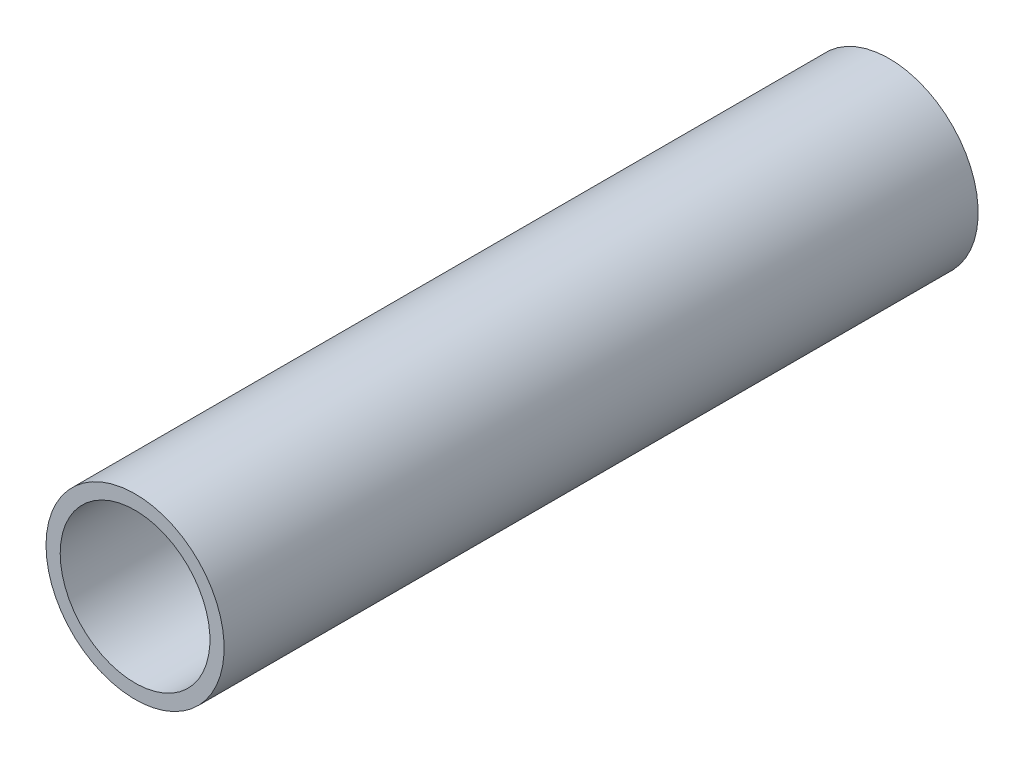
ISO-10303-21;
HEADER;
FILE_DESCRIPTION(('STEP AP214'),'2;1');
FILE_NAME('part.step','',(''),(''),'','','');
FILE_SCHEMA(('AUTOMOTIVE_DESIGN { 1 0 10303 214 1 1 1 1 }'));
ENDSEC;
DATA;
#1=APPLICATION_CONTEXT('core data for automotive mechanical design processes');
#2=APPLICATION_PROTOCOL_DEFINITION('international standard','automotive_design',2000,#1);
#3=PRODUCT_CONTEXT('',#1,'mechanical');
#4=PRODUCT('Part','Part','',(#3));
#5=PRODUCT_RELATED_PRODUCT_CATEGORY('part','',(#4));
#6=PRODUCT_DEFINITION_FORMATION('','',#4);
#7=PRODUCT_DEFINITION_CONTEXT('part definition',#1,'design');
#8=PRODUCT_DEFINITION('design','',#6,#7);
#9=PRODUCT_DEFINITION_SHAPE('','',#8);
#10=(LENGTH_UNIT() NAMED_UNIT(*) SI_UNIT(.MILLI.,.METRE.));
#11=(NAMED_UNIT(*) PLANE_ANGLE_UNIT() SI_UNIT($,.RADIAN.));
#12=(NAMED_UNIT(*) SI_UNIT($,.STERADIAN.) SOLID_ANGLE_UNIT());
#13=UNCERTAINTY_MEASURE_WITH_UNIT(LENGTH_MEASURE(1.E-05),#10,'distance_accuracy_value','');
#14=(GEOMETRIC_REPRESENTATION_CONTEXT(3) GLOBAL_UNCERTAINTY_ASSIGNED_CONTEXT((#13)) GLOBAL_UNIT_ASSIGNED_CONTEXT((#10,
#11,#12)) REPRESENTATION_CONTEXT('',''));
#15=CARTESIAN_POINT('',(0.,0.,0.));
#16=DIRECTION('',(0.,0.,1.));
#17=DIRECTION('',(1.,0.,0.));
#18=AXIS2_PLACEMENT_3D('',#15,#16,#17);
#19=CARTESIAN_POINT('',(0.,0.,40.48125));
#20=DIRECTION('',(0.,0.,-1.));
#21=DIRECTION('',(-1.,0.,0.));
#22=AXIS2_PLACEMENT_3D('',#19,#20,#21);
#23=CYLINDRICAL_SURFACE('',#22,8.0391);
#24=CARTESIAN_POINT('',(0.,0.,-40.48125));
#25=DIRECTION('',(0.,0.,-1.));
#26=DIRECTION('',(-1.,0.,0.));
#27=AXIS2_PLACEMENT_3D('',#24,#25,#26);
#28=CIRCLE('',#27,8.0391);
#29=CARTESIAN_POINT('',(-8.0391,0.,-40.48125));
#30=VERTEX_POINT('',#29);
#31=EDGE_CURVE('E27',#30,#30,#28,.T.);
#32=ORIENTED_EDGE('',*,*,#31,.T.);
#33=EDGE_LOOP('',(#32));
#34=FACE_BOUND('',#33,.T.);
#35=CARTESIAN_POINT('',(0.,0.,40.48125));
#36=DIRECTION('',(0.,0.,-1.));
#37=DIRECTION('',(-1.,0.,0.));
#38=AXIS2_PLACEMENT_3D('',#35,#36,#37);
#39=CIRCLE('',#38,8.0391);
#40=CARTESIAN_POINT('',(-8.0391,0.,40.48125));
#41=VERTEX_POINT('',#40);
#42=EDGE_CURVE('E18',#41,#41,#39,.T.);
#43=ORIENTED_EDGE('',*,*,#42,.F.);
#44=EDGE_LOOP('',(#43));
#45=FACE_BOUND('',#44,.T.);
#46=ADVANCED_FACE('F15',(#34,#45),#23,.F.);
#47=CARTESIAN_POINT('',(0.,0.,40.48125));
#48=DIRECTION('',(0.,0.,1.));
#49=DIRECTION('',(1.,0.,0.));
#50=AXIS2_PLACEMENT_3D('',#47,#48,#49);
#51=PLANE('',#50);
#52=ORIENTED_EDGE('',*,*,#42,.T.);
#53=EDGE_LOOP('',(#52));
#54=FACE_BOUND('',#53,.T.);
#55=CARTESIAN_POINT('',(0.,0.,40.48125));
#56=DIRECTION('',(0.,0.,-1.));
#57=DIRECTION('',(-1.,0.,0.));
#58=AXIS2_PLACEMENT_3D('',#55,#56,#57);
#59=CIRCLE('',#58,9.5631);
#60=CARTESIAN_POINT('',(-9.5631,0.,40.48125));
#61=VERTEX_POINT('',#60);
#62=EDGE_CURVE('E22',#61,#61,#59,.T.);
#63=ORIENTED_EDGE('',*,*,#62,.F.);
#64=EDGE_LOOP('',(#63));
#65=FACE_BOUND('',#64,.T.);
#66=ADVANCED_FACE('F35',(#54,#65),#51,.T.);
#67=CARTESIAN_POINT('',(0.,0.,-40.48125));
#68=DIRECTION('',(0.,0.,1.));
#69=DIRECTION('',(1.,0.,0.));
#70=AXIS2_PLACEMENT_3D('',#67,#68,#69);
#71=PLANE('',#70);
#72=ORIENTED_EDGE('',*,*,#31,.F.);
#73=EDGE_LOOP('',(#72));
#74=FACE_BOUND('',#73,.T.);
#75=CARTESIAN_POINT('',(0.,0.,-40.48125));
#76=DIRECTION('',(0.,0.,-1.));
#77=DIRECTION('',(-1.,0.,0.));
#78=AXIS2_PLACEMENT_3D('',#75,#76,#77);
#79=CIRCLE('',#78,9.5631);
#80=CARTESIAN_POINT('',(-9.5631,0.,-40.48125));
#81=VERTEX_POINT('',#80);
#82=EDGE_CURVE('E10',#81,#81,#79,.F.);
#83=ORIENTED_EDGE('',*,*,#82,.F.);
#84=EDGE_LOOP('',(#83));
#85=FACE_BOUND('',#84,.T.);
#86=ADVANCED_FACE('F43',(#74,#85),#71,.F.);
#87=CARTESIAN_POINT('',(0.,0.,40.48125));
#88=DIRECTION('',(0.,0.,-1.));
#89=DIRECTION('',(-1.,0.,0.));
#90=AXIS2_PLACEMENT_3D('',#87,#88,#89);
#91=CYLINDRICAL_SURFACE('',#90,9.5631);
#92=ORIENTED_EDGE('',*,*,#82,.T.);
#93=EDGE_LOOP('',(#92));
#94=FACE_BOUND('',#93,.T.);
#95=ORIENTED_EDGE('',*,*,#62,.T.);
#96=EDGE_LOOP('',(#95));
#97=FACE_BOUND('',#96,.T.);
#98=ADVANCED_FACE('F44',(#94,#97),#91,.T.);
#99=CLOSED_SHELL('',(#46,#66,#86,#98));
#100=MANIFOLD_SOLID_BREP('B1',#99);
#101=ADVANCED_BREP_SHAPE_REPRESENTATION('',(#18,#100),#14);
#102=SHAPE_DEFINITION_REPRESENTATION(#9,#101);
ENDSEC;
END-ISO-10303-21;
